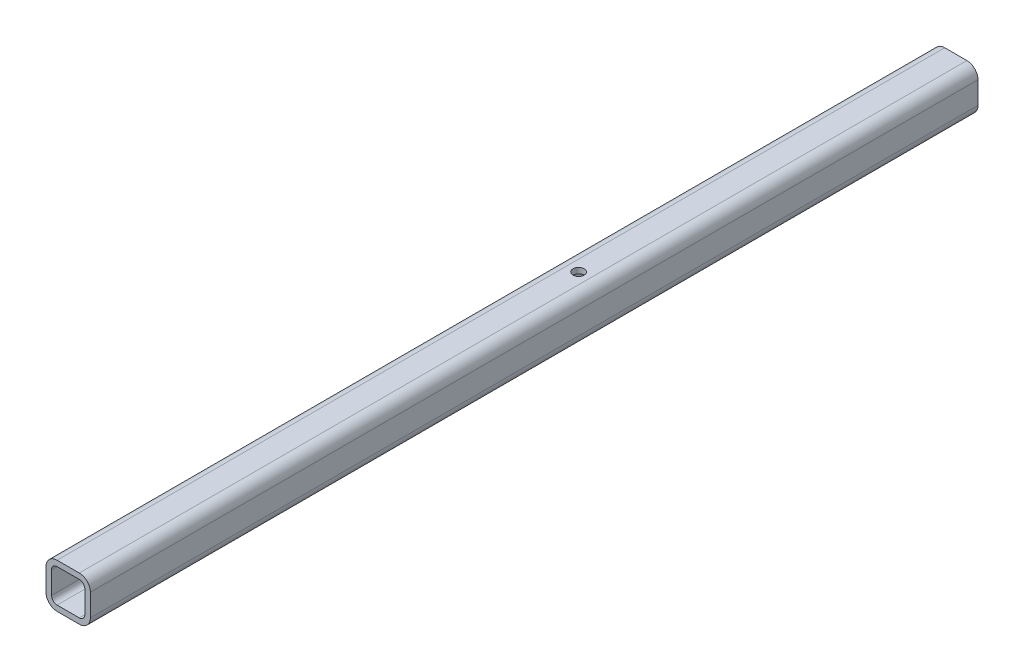
ISO-10303-21;
HEADER;
FILE_DESCRIPTION(('STEP AP214'),'2;1');
FILE_NAME('part.step','',(''),(''),'','','');
FILE_SCHEMA(('AUTOMOTIVE_DESIGN { 1 0 10303 214 1 1 1 1 }'));
ENDSEC;
DATA;
#1=APPLICATION_CONTEXT('core data for automotive mechanical design processes');
#2=APPLICATION_PROTOCOL_DEFINITION('international standard','automotive_design',2000,#1);
#3=PRODUCT_CONTEXT('',#1,'mechanical');
#4=PRODUCT('Part','Part','',(#3));
#5=PRODUCT_RELATED_PRODUCT_CATEGORY('part','',(#4));
#6=PRODUCT_DEFINITION_FORMATION('','',#4);
#7=PRODUCT_DEFINITION_CONTEXT('part definition',#1,'design');
#8=PRODUCT_DEFINITION('design','',#6,#7);
#9=PRODUCT_DEFINITION_SHAPE('','',#8);
#10=(LENGTH_UNIT() NAMED_UNIT(*) SI_UNIT(.MILLI.,.METRE.));
#11=(NAMED_UNIT(*) PLANE_ANGLE_UNIT() SI_UNIT($,.RADIAN.));
#12=(NAMED_UNIT(*) SI_UNIT($,.STERADIAN.) SOLID_ANGLE_UNIT());
#13=UNCERTAINTY_MEASURE_WITH_UNIT(LENGTH_MEASURE(1.E-05),#10,'distance_accuracy_value','');
#14=(GEOMETRIC_REPRESENTATION_CONTEXT(3) GLOBAL_UNCERTAINTY_ASSIGNED_CONTEXT((#13)) GLOBAL_UNIT_ASSIGNED_CONTEXT((#10,
#11,#12)) REPRESENTATION_CONTEXT('',''));
#15=CARTESIAN_POINT('',(0.,0.,0.));
#16=DIRECTION('',(0.,0.,1.));
#17=DIRECTION('',(1.,0.,0.));
#18=AXIS2_PLACEMENT_3D('',#15,#16,#17);
#19=CARTESIAN_POINT('',(38.1,38.1,508.));
#20=DIRECTION('',(0.,0.,1.));
#21=DIRECTION('',(1.,0.,0.));
#22=AXIS2_PLACEMENT_3D('',#19,#20,#21);
#23=PLANE('',#22);
#24=CARTESIAN_POINT('',(38.1,38.1,508.));
#25=DIRECTION('',(0.,0.,1.));
#26=DIRECTION('',(1.,0.,0.));
#27=AXIS2_PLACEMENT_3D('',#24,#25,#26);
#28=CIRCLE('',#27,12.7);
#29=CARTESIAN_POINT('',(50.8,38.1,508.));
#30=VERTEX_POINT('',#29);
#31=CARTESIAN_POINT('',(38.1,50.8,508.));
#32=VERTEX_POINT('',#31);
#33=EDGE_CURVE('E278',#30,#32,#28,.T.);
#34=ORIENTED_EDGE('',*,*,#33,.T.);
#35=DIRECTION('',(-1.,0.,0.));
#36=VECTOR('',#35,1.);
#37=CARTESIAN_POINT('',(38.1,50.8,508.));
#38=LINE('',#37,#36);
#39=CARTESIAN_POINT('',(12.7,50.8,508.));
#40=VERTEX_POINT('',#39);
#41=EDGE_CURVE('E281',#32,#40,#38,.T.);
#42=ORIENTED_EDGE('',*,*,#41,.T.);
#43=CARTESIAN_POINT('',(12.7,38.1,508.));
#44=DIRECTION('',(0.,0.,1.));
#45=DIRECTION('',(1.,0.,0.));
#46=AXIS2_PLACEMENT_3D('',#43,#44,#45);
#47=CIRCLE('',#46,12.7);
#48=CARTESIAN_POINT('',(0.,38.1,508.));
#49=VERTEX_POINT('',#48);
#50=EDGE_CURVE('E284',#40,#49,#47,.T.);
#51=ORIENTED_EDGE('',*,*,#50,.T.);
#52=DIRECTION('',(0.,-1.,0.));
#53=VECTOR('',#52,1.);
#54=CARTESIAN_POINT('',(0.,12.7,508.));
#55=LINE('',#54,#53);
#56=CARTESIAN_POINT('',(0.,12.7,508.));
#57=VERTEX_POINT('',#56);
#58=EDGE_CURVE('E286',#49,#57,#55,.T.);
#59=ORIENTED_EDGE('',*,*,#58,.T.);
#60=CARTESIAN_POINT('',(12.7,12.7,508.));
#61=DIRECTION('',(0.,0.,1.));
#62=DIRECTION('',(1.,0.,0.));
#63=AXIS2_PLACEMENT_3D('',#60,#61,#62);
#64=CIRCLE('',#63,12.7);
#65=CARTESIAN_POINT('',(12.7,0.,508.));
#66=VERTEX_POINT('',#65);
#67=EDGE_CURVE('E288',#57,#66,#64,.T.);
#68=ORIENTED_EDGE('',*,*,#67,.T.);
#69=DIRECTION('',(1.,0.,0.));
#70=VECTOR('',#69,1.);
#71=CARTESIAN_POINT('',(12.7,0.,508.));
#72=LINE('',#71,#70);
#73=CARTESIAN_POINT('',(38.1,0.,508.));
#74=VERTEX_POINT('',#73);
#75=EDGE_CURVE('E290',#66,#74,#72,.T.);
#76=ORIENTED_EDGE('',*,*,#75,.T.);
#77=CARTESIAN_POINT('',(38.1,12.7,508.));
#78=DIRECTION('',(0.,0.,1.));
#79=DIRECTION('',(1.,0.,0.));
#80=AXIS2_PLACEMENT_3D('',#77,#78,#79);
#81=CIRCLE('',#80,12.7);
#82=CARTESIAN_POINT('',(50.8,12.7,508.));
#83=VERTEX_POINT('',#82);
#84=EDGE_CURVE('E292',#74,#83,#81,.T.);
#85=ORIENTED_EDGE('',*,*,#84,.T.);
#86=DIRECTION('',(0.,1.,0.));
#87=VECTOR('',#86,1.);
#88=CARTESIAN_POINT('',(50.8,38.1,508.));
#89=LINE('',#88,#87);
#90=EDGE_CURVE('E294',#83,#30,#89,.T.);
#91=ORIENTED_EDGE('',*,*,#90,.T.);
#92=EDGE_LOOP('',(#34,#42,#51,#59,#68,#76,#85,#91));
#93=FACE_BOUND('',#92,.T.);
#94=DIRECTION('',(0.,-1.,0.));
#95=VECTOR('',#94,1.);
#96=CARTESIAN_POINT('',(6.35,12.7,508.));
#97=LINE('',#96,#95);
#98=CARTESIAN_POINT('',(6.35,38.1,508.));
#99=VERTEX_POINT('',#98);
#100=CARTESIAN_POINT('',(6.35,12.7,508.));
#101=VERTEX_POINT('',#100);
#102=EDGE_CURVE('E221',#99,#101,#97,.T.);
#103=ORIENTED_EDGE('',*,*,#102,.F.);
#104=CARTESIAN_POINT('',(12.7,38.1,508.));
#105=DIRECTION('',(0.,0.,1.));
#106=DIRECTION('',(1.,0.,0.));
#107=AXIS2_PLACEMENT_3D('',#104,#105,#106);
#108=CIRCLE('',#107,6.35);
#109=CARTESIAN_POINT('',(12.7,44.45,508.));
#110=VERTEX_POINT('',#109);
#111=EDGE_CURVE('E219',#110,#99,#108,.T.);
#112=ORIENTED_EDGE('',*,*,#111,.F.);
#113=DIRECTION('',(-1.,0.,0.));
#114=VECTOR('',#113,1.);
#115=CARTESIAN_POINT('',(38.1,44.45,508.));
#116=LINE('',#115,#114);
#117=CARTESIAN_POINT('',(38.1,44.45,508.));
#118=VERTEX_POINT('',#117);
#119=EDGE_CURVE('E235',#118,#110,#116,.T.);
#120=ORIENTED_EDGE('',*,*,#119,.F.);
#121=CARTESIAN_POINT('',(38.1,38.1,508.));
#122=DIRECTION('',(0.,0.,1.));
#123=DIRECTION('',(1.,0.,0.));
#124=AXIS2_PLACEMENT_3D('',#121,#122,#123);
#125=CIRCLE('',#124,6.35);
#126=CARTESIAN_POINT('',(44.45,38.1,508.));
#127=VERTEX_POINT('',#126);
#128=EDGE_CURVE('E232',#127,#118,#125,.T.);
#129=ORIENTED_EDGE('',*,*,#128,.F.);
#130=DIRECTION('',(0.,1.,0.));
#131=VECTOR('',#130,1.);
#132=CARTESIAN_POINT('',(44.45,38.1,508.));
#133=LINE('',#132,#131);
#134=CARTESIAN_POINT('',(44.45,12.7,508.));
#135=VERTEX_POINT('',#134);
#136=EDGE_CURVE('E230',#135,#127,#133,.T.);
#137=ORIENTED_EDGE('',*,*,#136,.F.);
#138=CARTESIAN_POINT('',(38.1,12.7,508.));
#139=DIRECTION('',(0.,0.,1.));
#140=DIRECTION('',(1.,0.,0.));
#141=AXIS2_PLACEMENT_3D('',#138,#139,#140);
#142=CIRCLE('',#141,6.35);
#143=CARTESIAN_POINT('',(38.1,6.35,508.));
#144=VERTEX_POINT('',#143);
#145=EDGE_CURVE('E228',#144,#135,#142,.T.);
#146=ORIENTED_EDGE('',*,*,#145,.F.);
#147=DIRECTION('',(1.,0.,0.));
#148=VECTOR('',#147,1.);
#149=CARTESIAN_POINT('',(12.7,6.34999999999999,508.));
#150=LINE('',#149,#148);
#151=CARTESIAN_POINT('',(12.7,6.34999999999999,508.));
#152=VERTEX_POINT('',#151);
#153=EDGE_CURVE('E226',#152,#144,#150,.T.);
#154=ORIENTED_EDGE('',*,*,#153,.F.);
#155=CARTESIAN_POINT('',(12.7,12.7,508.));
#156=DIRECTION('',(0.,0.,1.));
#157=DIRECTION('',(1.,0.,0.));
#158=AXIS2_PLACEMENT_3D('',#155,#156,#157);
#159=CIRCLE('',#158,6.35);
#160=EDGE_CURVE('E224',#101,#152,#159,.T.);
#161=ORIENTED_EDGE('',*,*,#160,.F.);
#162=EDGE_LOOP('',(#103,#112,#120,#129,#137,#146,#154,#161));
#163=FACE_BOUND('',#162,.T.);
#164=ADVANCED_FACE('F35',(#93,#163),#23,.T.);
#165=CARTESIAN_POINT('',(38.1,38.1,-508.));
#166=DIRECTION('',(0.,0.,1.));
#167=DIRECTION('',(1.,0.,0.));
#168=AXIS2_PLACEMENT_3D('',#165,#166,#167);
#169=PLANE('',#168);
#170=CARTESIAN_POINT('',(38.1,38.1,-508.));
#171=DIRECTION('',(0.,0.,1.));
#172=DIRECTION('',(1.,0.,0.));
#173=AXIS2_PLACEMENT_3D('',#170,#171,#172);
#174=CIRCLE('',#173,12.7);
#175=CARTESIAN_POINT('',(50.8,38.1,-508.));
#176=VERTEX_POINT('',#175);
#177=CARTESIAN_POINT('',(38.1,50.8,-508.));
#178=VERTEX_POINT('',#177);
#179=EDGE_CURVE('E277',#176,#178,#174,.T.);
#180=ORIENTED_EDGE('',*,*,#179,.F.);
#181=DIRECTION('',(0.,1.,0.));
#182=VECTOR('',#181,1.);
#183=CARTESIAN_POINT('',(50.8,38.1,-508.));
#184=LINE('',#183,#182);
#185=CARTESIAN_POINT('',(50.8,12.7,-508.));
#186=VERTEX_POINT('',#185);
#187=EDGE_CURVE('E282',#186,#176,#184,.T.);
#188=ORIENTED_EDGE('',*,*,#187,.F.);
#189=CARTESIAN_POINT('',(38.1,12.7,-508.));
#190=DIRECTION('',(0.,0.,1.));
#191=DIRECTION('',(1.,0.,0.));
#192=AXIS2_PLACEMENT_3D('',#189,#190,#191);
#193=CIRCLE('',#192,12.7);
#194=CARTESIAN_POINT('',(38.1,0.,-508.));
#195=VERTEX_POINT('',#194);
#196=EDGE_CURVE('E309',#195,#186,#193,.T.);
#197=ORIENTED_EDGE('',*,*,#196,.F.);
#198=DIRECTION('',(1.,0.,0.));
#199=VECTOR('',#198,1.);
#200=CARTESIAN_POINT('',(12.7,0.,-508.));
#201=LINE('',#200,#199);
#202=CARTESIAN_POINT('',(12.7,0.,-508.));
#203=VERTEX_POINT('',#202);
#204=EDGE_CURVE('E307',#203,#195,#201,.T.);
#205=ORIENTED_EDGE('',*,*,#204,.F.);
#206=CARTESIAN_POINT('',(12.7,12.7,-508.));
#207=DIRECTION('',(0.,0.,1.));
#208=DIRECTION('',(1.,0.,0.));
#209=AXIS2_PLACEMENT_3D('',#206,#207,#208);
#210=CIRCLE('',#209,12.7);
#211=CARTESIAN_POINT('',(0.,12.7,-508.));
#212=VERTEX_POINT('',#211);
#213=EDGE_CURVE('E305',#212,#203,#210,.T.);
#214=ORIENTED_EDGE('',*,*,#213,.F.);
#215=DIRECTION('',(0.,-1.,0.));
#216=VECTOR('',#215,1.);
#217=CARTESIAN_POINT('',(0.,12.7,-508.));
#218=LINE('',#217,#216);
#219=CARTESIAN_POINT('',(0.,38.1,-508.));
#220=VERTEX_POINT('',#219);
#221=EDGE_CURVE('E303',#220,#212,#218,.T.);
#222=ORIENTED_EDGE('',*,*,#221,.F.);
#223=CARTESIAN_POINT('',(12.7,38.1,-508.));
#224=DIRECTION('',(0.,0.,1.));
#225=DIRECTION('',(1.,0.,0.));
#226=AXIS2_PLACEMENT_3D('',#223,#224,#225);
#227=CIRCLE('',#226,12.7);
#228=CARTESIAN_POINT('',(12.7,50.8,-508.));
#229=VERTEX_POINT('',#228);
#230=EDGE_CURVE('E301',#229,#220,#227,.T.);
#231=ORIENTED_EDGE('',*,*,#230,.F.);
#232=DIRECTION('',(-1.,0.,0.));
#233=VECTOR('',#232,1.);
#234=CARTESIAN_POINT('',(38.1,50.8,-508.));
#235=LINE('',#234,#233);
#236=EDGE_CURVE('E299',#178,#229,#235,.T.);
#237=ORIENTED_EDGE('',*,*,#236,.F.);
#238=EDGE_LOOP('',(#180,#188,#197,#205,#214,#222,#231,#237));
#239=FACE_BOUND('',#238,.T.);
#240=CARTESIAN_POINT('',(12.7,38.1,-508.));
#241=DIRECTION('',(0.,0.,1.));
#242=DIRECTION('',(1.,0.,0.));
#243=AXIS2_PLACEMENT_3D('',#240,#241,#242);
#244=CIRCLE('',#243,6.35);
#245=CARTESIAN_POINT('',(12.7,44.45,-508.));
#246=VERTEX_POINT('',#245);
#247=CARTESIAN_POINT('',(6.35,38.1,-508.));
#248=VERTEX_POINT('',#247);
#249=EDGE_CURVE('E218',#246,#248,#244,.T.);
#250=ORIENTED_EDGE('',*,*,#249,.T.);
#251=DIRECTION('',(0.,-1.,0.));
#252=VECTOR('',#251,1.);
#253=CARTESIAN_POINT('',(6.35,12.7,-508.));
#254=LINE('',#253,#252);
#255=CARTESIAN_POINT('',(6.35,12.7,-508.));
#256=VERTEX_POINT('',#255);
#257=EDGE_CURVE('E240',#248,#256,#254,.T.);
#258=ORIENTED_EDGE('',*,*,#257,.T.);
#259=CARTESIAN_POINT('',(12.7,12.7,-508.));
#260=DIRECTION('',(0.,0.,1.));
#261=DIRECTION('',(1.,0.,0.));
#262=AXIS2_PLACEMENT_3D('',#259,#260,#261);
#263=CIRCLE('',#262,6.35);
#264=CARTESIAN_POINT('',(12.7,6.34999999999999,-508.));
#265=VERTEX_POINT('',#264);
#266=EDGE_CURVE('E243',#256,#265,#263,.T.);
#267=ORIENTED_EDGE('',*,*,#266,.T.);
#268=DIRECTION('',(1.,0.,0.));
#269=VECTOR('',#268,1.);
#270=CARTESIAN_POINT('',(12.7,6.34999999999999,-508.));
#271=LINE('',#270,#269);
#272=CARTESIAN_POINT('',(38.1,6.35,-508.));
#273=VERTEX_POINT('',#272);
#274=EDGE_CURVE('E246',#265,#273,#271,.T.);
#275=ORIENTED_EDGE('',*,*,#274,.T.);
#276=CARTESIAN_POINT('',(38.1,12.7,-508.));
#277=DIRECTION('',(0.,0.,1.));
#278=DIRECTION('',(1.,0.,0.));
#279=AXIS2_PLACEMENT_3D('',#276,#277,#278);
#280=CIRCLE('',#279,6.35);
#281=CARTESIAN_POINT('',(44.45,12.7,-508.));
#282=VERTEX_POINT('',#281);
#283=EDGE_CURVE('E249',#273,#282,#280,.T.);
#284=ORIENTED_EDGE('',*,*,#283,.T.);
#285=DIRECTION('',(0.,1.,0.));
#286=VECTOR('',#285,1.);
#287=CARTESIAN_POINT('',(44.45,38.1,-508.));
#288=LINE('',#287,#286);
#289=CARTESIAN_POINT('',(44.45,38.1,-508.));
#290=VERTEX_POINT('',#289);
#291=EDGE_CURVE('E252',#282,#290,#288,.T.);
#292=ORIENTED_EDGE('',*,*,#291,.T.);
#293=CARTESIAN_POINT('',(38.1,38.1,-508.));
#294=DIRECTION('',(0.,0.,1.));
#295=DIRECTION('',(1.,0.,0.));
#296=AXIS2_PLACEMENT_3D('',#293,#294,#295);
#297=CIRCLE('',#296,6.35);
#298=CARTESIAN_POINT('',(38.1,44.45,-508.));
#299=VERTEX_POINT('',#298);
#300=EDGE_CURVE('E255',#290,#299,#297,.T.);
#301=ORIENTED_EDGE('',*,*,#300,.T.);
#302=DIRECTION('',(-1.,0.,0.));
#303=VECTOR('',#302,1.);
#304=CARTESIAN_POINT('',(38.1,44.45,-508.));
#305=LINE('',#304,#303);
#306=EDGE_CURVE('E222',#299,#246,#305,.T.);
#307=ORIENTED_EDGE('',*,*,#306,.T.);
#308=EDGE_LOOP('',(#250,#258,#267,#275,#284,#292,#301,#307));
#309=FACE_BOUND('',#308,.T.);
#310=ADVANCED_FACE('F340',(#239,#309),#169,.F.);
#311=CARTESIAN_POINT('',(38.1,38.1,508.));
#312=DIRECTION('',(0.,0.,-1.));
#313=DIRECTION('',(-1.,0.,0.));
#314=AXIS2_PLACEMENT_3D('',#311,#312,#313);
#315=CYLINDRICAL_SURFACE('',#314,12.7);
#316=ORIENTED_EDGE('',*,*,#179,.T.);
#317=DIRECTION('',(0.,0.,-1.));
#318=VECTOR('',#317,1.);
#319=CARTESIAN_POINT('',(38.1,50.8,508.));
#320=LINE('',#319,#318);
#321=EDGE_CURVE('E11',#32,#178,#320,.T.);
#322=ORIENTED_EDGE('',*,*,#321,.F.);
#323=ORIENTED_EDGE('',*,*,#33,.F.);
#324=DIRECTION('',(0.,0.,-1.));
#325=VECTOR('',#324,1.);
#326=CARTESIAN_POINT('',(50.8,38.1,508.));
#327=LINE('',#326,#325);
#328=EDGE_CURVE('E296',#30,#176,#327,.T.);
#329=ORIENTED_EDGE('',*,*,#328,.T.);
#330=EDGE_LOOP('',(#316,#322,#323,#329));
#331=FACE_BOUND('',#330,.T.);
#332=ADVANCED_FACE('F37',(#331),#315,.T.);
#333=CARTESIAN_POINT('',(38.1,50.8,508.));
#334=DIRECTION('',(0.,-1.,0.));
#335=DIRECTION('',(1.,0.,0.));
#336=AXIS2_PLACEMENT_3D('',#333,#334,#335);
#337=PLANE('',#336);
#338=CARTESIAN_POINT('',(25.4,50.8,-76.1999999999999));
#339=DIRECTION('',(0.,1.,0.));
#340=DIRECTION('',(0.,0.,1.));
#341=AXIS2_PLACEMENT_3D('',#338,#339,#340);
#342=CIRCLE('',#341,6.34999999999999);
#343=CARTESIAN_POINT('',(25.4,50.8,-69.8499999999999));
#344=VERTEX_POINT('',#343);
#345=EDGE_CURVE('E190',#344,#344,#342,.T.);
#346=ORIENTED_EDGE('',*,*,#345,.F.);
#347=EDGE_LOOP('',(#346));
#348=FACE_BOUND('',#347,.T.);
#349=ORIENTED_EDGE('',*,*,#236,.T.);
#350=DIRECTION('',(0.,0.,-1.));
#351=VECTOR('',#350,1.);
#352=CARTESIAN_POINT('',(12.7,50.8,508.));
#353=LINE('',#352,#351);
#354=EDGE_CURVE('E44',#40,#229,#353,.T.);
#355=ORIENTED_EDGE('',*,*,#354,.F.);
#356=ORIENTED_EDGE('',*,*,#41,.F.);
#357=ORIENTED_EDGE('',*,*,#321,.T.);
#358=EDGE_LOOP('',(#349,#355,#356,#357));
#359=FACE_BOUND('',#358,.T.);
#360=ADVANCED_FACE('F358',(#348,#359),#337,.F.);
#361=CARTESIAN_POINT('',(12.7,38.1,508.));
#362=DIRECTION('',(0.,0.,-1.));
#363=DIRECTION('',(-1.,0.,0.));
#364=AXIS2_PLACEMENT_3D('',#361,#362,#363);
#365=CYLINDRICAL_SURFACE('',#364,12.7);
#366=ORIENTED_EDGE('',*,*,#230,.T.);
#367=DIRECTION('',(0.,0.,-1.));
#368=VECTOR('',#367,1.);
#369=CARTESIAN_POINT('',(0.,38.1,508.));
#370=LINE('',#369,#368);
#371=EDGE_CURVE('E326',#49,#220,#370,.T.);
#372=ORIENTED_EDGE('',*,*,#371,.F.);
#373=ORIENTED_EDGE('',*,*,#50,.F.);
#374=ORIENTED_EDGE('',*,*,#354,.T.);
#375=EDGE_LOOP('',(#366,#372,#373,#374));
#376=FACE_BOUND('',#375,.T.);
#377=ADVANCED_FACE('F334',(#376),#365,.T.);
#378=CARTESIAN_POINT('',(0.,12.7,508.));
#379=DIRECTION('',(1.,0.,0.));
#380=DIRECTION('',(0.,1.,0.));
#381=AXIS2_PLACEMENT_3D('',#378,#379,#380);
#382=PLANE('',#381);
#383=ORIENTED_EDGE('',*,*,#221,.T.);
#384=DIRECTION('',(0.,0.,-1.));
#385=VECTOR('',#384,1.);
#386=CARTESIAN_POINT('',(0.,12.7,508.));
#387=LINE('',#386,#385);
#388=EDGE_CURVE('E323',#57,#212,#387,.T.);
#389=ORIENTED_EDGE('',*,*,#388,.F.);
#390=ORIENTED_EDGE('',*,*,#58,.F.);
#391=ORIENTED_EDGE('',*,*,#371,.T.);
#392=EDGE_LOOP('',(#383,#389,#390,#391));
#393=FACE_BOUND('',#392,.T.);
#394=ADVANCED_FACE('F346',(#393),#382,.F.);
#395=CARTESIAN_POINT('',(12.7,12.7,508.));
#396=DIRECTION('',(0.,0.,-1.));
#397=DIRECTION('',(-1.,0.,0.));
#398=AXIS2_PLACEMENT_3D('',#395,#396,#397);
#399=CYLINDRICAL_SURFACE('',#398,12.7);
#400=ORIENTED_EDGE('',*,*,#213,.T.);
#401=DIRECTION('',(0.,0.,-1.));
#402=VECTOR('',#401,1.);
#403=CARTESIAN_POINT('',(12.7,0.,508.));
#404=LINE('',#403,#402);
#405=EDGE_CURVE('E320',#66,#203,#404,.T.);
#406=ORIENTED_EDGE('',*,*,#405,.F.);
#407=ORIENTED_EDGE('',*,*,#67,.F.);
#408=ORIENTED_EDGE('',*,*,#388,.T.);
#409=EDGE_LOOP('',(#400,#406,#407,#408));
#410=FACE_BOUND('',#409,.T.);
#411=ADVANCED_FACE('F350',(#410),#399,.T.);
#412=CARTESIAN_POINT('',(12.7,0.,508.));
#413=DIRECTION('',(0.,1.,0.));
#414=DIRECTION('',(-1.,0.,0.));
#415=AXIS2_PLACEMENT_3D('',#412,#413,#414);
#416=PLANE('',#415);
#417=DIRECTION('',(0.,0.,1.));
#418=VECTOR('',#417,1.);
#419=CARTESIAN_POINT('',(31.75,0.,-488.95));
#420=LINE('',#419,#418);
#421=CARTESIAN_POINT('',(31.75,0.,-488.95));
#422=VERTEX_POINT('',#421);
#423=CARTESIAN_POINT('',(31.75,0.,-469.9));
#424=VERTEX_POINT('',#423);
#425=EDGE_CURVE('E196',#422,#424,#420,.T.);
#426=ORIENTED_EDGE('',*,*,#425,.F.);
#427=CARTESIAN_POINT('',(25.4,0.,-488.95));
#428=DIRECTION('',(0.,-1.,0.));
#429=DIRECTION('',(1.,0.,0.));
#430=AXIS2_PLACEMENT_3D('',#427,#428,#429);
#431=CIRCLE('',#430,6.35);
#432=CARTESIAN_POINT('',(19.05,0.,-488.95));
#433=VERTEX_POINT('',#432);
#434=EDGE_CURVE('E51',#433,#422,#431,.T.);
#435=ORIENTED_EDGE('',*,*,#434,.F.);
#436=DIRECTION('',(0.,0.,-1.));
#437=VECTOR('',#436,1.);
#438=CARTESIAN_POINT('',(19.05,0.,-488.95));
#439=LINE('',#438,#437);
#440=CARTESIAN_POINT('',(19.05,0.,-469.9));
#441=VERTEX_POINT('',#440);
#442=EDGE_CURVE('E183',#441,#433,#439,.T.);
#443=ORIENTED_EDGE('',*,*,#442,.F.);
#444=CARTESIAN_POINT('',(25.4,0.,-469.9));
#445=DIRECTION('',(0.,-1.,0.));
#446=DIRECTION('',(1.,0.,0.));
#447=AXIS2_PLACEMENT_3D('',#444,#445,#446);
#448=CIRCLE('',#447,6.35);
#449=EDGE_CURVE('E191',#424,#441,#448,.T.);
#450=ORIENTED_EDGE('',*,*,#449,.F.);
#451=EDGE_LOOP('',(#426,#435,#443,#450));
#452=FACE_BOUND('',#451,.T.);
#453=CARTESIAN_POINT('',(25.4,0.,-76.1999999999999));
#454=DIRECTION('',(0.,1.,0.));
#455=DIRECTION('',(0.,0.,1.));
#456=AXIS2_PLACEMENT_3D('',#453,#454,#455);
#457=CIRCLE('',#456,6.34999999999999);
#458=CARTESIAN_POINT('',(25.4,0.,-69.8499999999999));
#459=VERTEX_POINT('',#458);
#460=EDGE_CURVE('E212',#459,#459,#457,.T.);
#461=ORIENTED_EDGE('',*,*,#460,.T.);
#462=EDGE_LOOP('',(#461));
#463=FACE_BOUND('',#462,.T.);
#464=ORIENTED_EDGE('',*,*,#204,.T.);
#465=DIRECTION('',(0.,0.,-1.));
#466=VECTOR('',#465,1.);
#467=CARTESIAN_POINT('',(38.1,0.,508.));
#468=LINE('',#467,#466);
#469=EDGE_CURVE('E317',#74,#195,#468,.T.);
#470=ORIENTED_EDGE('',*,*,#469,.F.);
#471=ORIENTED_EDGE('',*,*,#75,.F.);
#472=ORIENTED_EDGE('',*,*,#405,.T.);
#473=EDGE_LOOP('',(#464,#470,#471,#472));
#474=FACE_BOUND('',#473,.T.);
#475=ADVANCED_FACE('F194',(#452,#463,#474),#416,.F.);
#476=CARTESIAN_POINT('',(38.1,12.7,508.));
#477=DIRECTION('',(0.,0.,-1.));
#478=DIRECTION('',(-1.,0.,0.));
#479=AXIS2_PLACEMENT_3D('',#476,#477,#478);
#480=CYLINDRICAL_SURFACE('',#479,12.7);
#481=ORIENTED_EDGE('',*,*,#196,.T.);
#482=DIRECTION('',(0.,0.,-1.));
#483=VECTOR('',#482,1.);
#484=CARTESIAN_POINT('',(50.8,12.7,508.));
#485=LINE('',#484,#483);
#486=EDGE_CURVE('E314',#83,#186,#485,.T.);
#487=ORIENTED_EDGE('',*,*,#486,.F.);
#488=ORIENTED_EDGE('',*,*,#84,.F.);
#489=ORIENTED_EDGE('',*,*,#469,.T.);
#490=EDGE_LOOP('',(#481,#487,#488,#489));
#491=FACE_BOUND('',#490,.T.);
#492=ADVANCED_FACE('F369',(#491),#480,.T.);
#493=CARTESIAN_POINT('',(50.8,38.1,508.));
#494=DIRECTION('',(-1.,0.,0.));
#495=DIRECTION('',(0.,-1.,0.));
#496=AXIS2_PLACEMENT_3D('',#493,#494,#495);
#497=PLANE('',#496);
#498=ORIENTED_EDGE('',*,*,#187,.T.);
#499=ORIENTED_EDGE('',*,*,#328,.F.);
#500=ORIENTED_EDGE('',*,*,#90,.F.);
#501=ORIENTED_EDGE('',*,*,#486,.T.);
#502=EDGE_LOOP('',(#498,#499,#500,#501));
#503=FACE_BOUND('',#502,.T.);
#504=ADVANCED_FACE('F364',(#503),#497,.F.);
#505=CARTESIAN_POINT('',(12.7,38.1,508.));
#506=DIRECTION('',(0.,0.,-1.));
#507=DIRECTION('',(-1.,0.,0.));
#508=AXIS2_PLACEMENT_3D('',#505,#506,#507);
#509=CYLINDRICAL_SURFACE('',#508,6.35);
#510=ORIENTED_EDGE('',*,*,#249,.F.);
#511=DIRECTION('',(0.,0.,-1.));
#512=VECTOR('',#511,1.);
#513=CARTESIAN_POINT('',(12.7,44.45,508.));
#514=LINE('',#513,#512);
#515=EDGE_CURVE('E237',#110,#246,#514,.T.);
#516=ORIENTED_EDGE('',*,*,#515,.F.);
#517=ORIENTED_EDGE('',*,*,#111,.T.);
#518=DIRECTION('',(0.,0.,-1.));
#519=VECTOR('',#518,1.);
#520=CARTESIAN_POINT('',(6.35,38.1,508.));
#521=LINE('',#520,#519);
#522=EDGE_CURVE('E274',#99,#248,#521,.T.);
#523=ORIENTED_EDGE('',*,*,#522,.T.);
#524=EDGE_LOOP('',(#510,#516,#517,#523));
#525=FACE_BOUND('',#524,.T.);
#526=ADVANCED_FACE('F386',(#525),#509,.F.);
#527=CARTESIAN_POINT('',(6.35,12.7,508.));
#528=DIRECTION('',(1.,0.,0.));
#529=DIRECTION('',(0.,1.,0.));
#530=AXIS2_PLACEMENT_3D('',#527,#528,#529);
#531=PLANE('',#530);
#532=ORIENTED_EDGE('',*,*,#257,.F.);
#533=ORIENTED_EDGE('',*,*,#522,.F.);
#534=ORIENTED_EDGE('',*,*,#102,.T.);
#535=DIRECTION('',(0.,0.,-1.));
#536=VECTOR('',#535,1.);
#537=CARTESIAN_POINT('',(6.35,12.7,508.));
#538=LINE('',#537,#536);
#539=EDGE_CURVE('E272',#101,#256,#538,.T.);
#540=ORIENTED_EDGE('',*,*,#539,.T.);
#541=EDGE_LOOP('',(#532,#533,#534,#540));
#542=FACE_BOUND('',#541,.T.);
#543=ADVANCED_FACE('F393',(#542),#531,.T.);
#544=CARTESIAN_POINT('',(12.7,12.7,508.));
#545=DIRECTION('',(0.,0.,-1.));
#546=DIRECTION('',(-1.,0.,0.));
#547=AXIS2_PLACEMENT_3D('',#544,#545,#546);
#548=CYLINDRICAL_SURFACE('',#547,6.35);
#549=ORIENTED_EDGE('',*,*,#266,.F.);
#550=ORIENTED_EDGE('',*,*,#539,.F.);
#551=ORIENTED_EDGE('',*,*,#160,.T.);
#552=DIRECTION('',(0.,0.,-1.));
#553=VECTOR('',#552,1.);
#554=CARTESIAN_POINT('',(12.7,6.34999999999999,508.));
#555=LINE('',#554,#553);
#556=EDGE_CURVE('E270',#152,#265,#555,.T.);
#557=ORIENTED_EDGE('',*,*,#556,.T.);
#558=EDGE_LOOP('',(#549,#550,#551,#557));
#559=FACE_BOUND('',#558,.T.);
#560=ADVANCED_FACE('F398',(#559),#548,.F.);
#561=CARTESIAN_POINT('',(12.7,6.34999999999999,508.));
#562=DIRECTION('',(0.,1.,0.));
#563=DIRECTION('',(-1.,0.,0.));
#564=AXIS2_PLACEMENT_3D('',#561,#562,#563);
#565=PLANE('',#564);
#566=CARTESIAN_POINT('',(25.4,6.35,-488.95));
#567=DIRECTION('',(0.,1.,0.));
#568=DIRECTION('',(-1.,0.,0.));
#569=AXIS2_PLACEMENT_3D('',#566,#567,#568);
#570=CIRCLE('',#569,6.35);
#571=CARTESIAN_POINT('',(19.05,6.34999999999999,-488.95));
#572=VERTEX_POINT('',#571);
#573=CARTESIAN_POINT('',(31.75,6.35,-488.95));
#574=VERTEX_POINT('',#573);
#575=EDGE_CURVE('E176',#572,#574,#570,.F.);
#576=ORIENTED_EDGE('',*,*,#575,.T.);
#577=DIRECTION('',(0.,0.,1.));
#578=VECTOR('',#577,1.);
#579=CARTESIAN_POINT('',(31.75,6.35,-488.95));
#580=LINE('',#579,#578);
#581=CARTESIAN_POINT('',(31.75,6.35,-469.9));
#582=VERTEX_POINT('',#581);
#583=EDGE_CURVE('E199',#574,#582,#580,.T.);
#584=ORIENTED_EDGE('',*,*,#583,.T.);
#585=CARTESIAN_POINT('',(25.4,6.35,-469.9));
#586=DIRECTION('',(0.,1.,0.));
#587=DIRECTION('',(-1.,0.,0.));
#588=AXIS2_PLACEMENT_3D('',#585,#586,#587);
#589=CIRCLE('',#588,6.35);
#590=CARTESIAN_POINT('',(19.05,6.35,-469.9));
#591=VERTEX_POINT('',#590);
#592=EDGE_CURVE('E179',#582,#591,#589,.F.);
#593=ORIENTED_EDGE('',*,*,#592,.T.);
#594=DIRECTION('',(0.,0.,-1.));
#595=VECTOR('',#594,1.);
#596=CARTESIAN_POINT('',(19.05,6.34999999999999,-488.95));
#597=LINE('',#596,#595);
#598=EDGE_CURVE('E180',#591,#572,#597,.T.);
#599=ORIENTED_EDGE('',*,*,#598,.T.);
#600=EDGE_LOOP('',(#576,#584,#593,#599));
#601=FACE_BOUND('',#600,.T.);
#602=CARTESIAN_POINT('',(25.4,6.34999999999999,-76.1999999999999));
#603=DIRECTION('',(0.,1.,0.));
#604=DIRECTION('',(-1.,0.,0.));
#605=AXIS2_PLACEMENT_3D('',#602,#603,#604);
#606=CIRCLE('',#605,6.34999999999999);
#607=CARTESIAN_POINT('',(19.05,6.34999999999999,-76.1999999999999));
#608=VERTEX_POINT('',#607);
#609=EDGE_CURVE('E215',#608,#608,#606,.T.);
#610=ORIENTED_EDGE('',*,*,#609,.F.);
#611=EDGE_LOOP('',(#610));
#612=FACE_BOUND('',#611,.T.);
#613=ORIENTED_EDGE('',*,*,#274,.F.);
#614=ORIENTED_EDGE('',*,*,#556,.F.);
#615=ORIENTED_EDGE('',*,*,#153,.T.);
#616=DIRECTION('',(0.,0.,-1.));
#617=VECTOR('',#616,1.);
#618=CARTESIAN_POINT('',(38.1,6.35,508.));
#619=LINE('',#618,#617);
#620=EDGE_CURVE('E268',#144,#273,#619,.T.);
#621=ORIENTED_EDGE('',*,*,#620,.T.);
#622=EDGE_LOOP('',(#613,#614,#615,#621));
#623=FACE_BOUND('',#622,.T.);
#624=ADVANCED_FACE('F423',(#601,#612,#623),#565,.T.);
#625=CARTESIAN_POINT('',(38.1,12.7,508.));
#626=DIRECTION('',(0.,0.,-1.));
#627=DIRECTION('',(-1.,0.,0.));
#628=AXIS2_PLACEMENT_3D('',#625,#626,#627);
#629=CYLINDRICAL_SURFACE('',#628,6.35);
#630=ORIENTED_EDGE('',*,*,#283,.F.);
#631=ORIENTED_EDGE('',*,*,#620,.F.);
#632=ORIENTED_EDGE('',*,*,#145,.T.);
#633=DIRECTION('',(0.,0.,-1.));
#634=VECTOR('',#633,1.);
#635=CARTESIAN_POINT('',(44.45,12.7,508.));
#636=LINE('',#635,#634);
#637=EDGE_CURVE('E266',#135,#282,#636,.T.);
#638=ORIENTED_EDGE('',*,*,#637,.T.);
#639=EDGE_LOOP('',(#630,#631,#632,#638));
#640=FACE_BOUND('',#639,.T.);
#641=ADVANCED_FACE('F428',(#640),#629,.F.);
#642=CARTESIAN_POINT('',(44.45,38.1,508.));
#643=DIRECTION('',(-1.,0.,0.));
#644=DIRECTION('',(0.,-1.,0.));
#645=AXIS2_PLACEMENT_3D('',#642,#643,#644);
#646=PLANE('',#645);
#647=ORIENTED_EDGE('',*,*,#291,.F.);
#648=ORIENTED_EDGE('',*,*,#637,.F.);
#649=ORIENTED_EDGE('',*,*,#136,.T.);
#650=DIRECTION('',(0.,0.,-1.));
#651=VECTOR('',#650,1.);
#652=CARTESIAN_POINT('',(44.45,38.1,508.));
#653=LINE('',#652,#651);
#654=EDGE_CURVE('E264',#127,#290,#653,.T.);
#655=ORIENTED_EDGE('',*,*,#654,.T.);
#656=EDGE_LOOP('',(#647,#648,#649,#655));
#657=FACE_BOUND('',#656,.T.);
#658=ADVANCED_FACE('F431',(#657),#646,.T.);
#659=CARTESIAN_POINT('',(38.1,38.1,508.));
#660=DIRECTION('',(0.,0.,-1.));
#661=DIRECTION('',(-1.,0.,0.));
#662=AXIS2_PLACEMENT_3D('',#659,#660,#661);
#663=CYLINDRICAL_SURFACE('',#662,6.35);
#664=ORIENTED_EDGE('',*,*,#300,.F.);
#665=ORIENTED_EDGE('',*,*,#654,.F.);
#666=ORIENTED_EDGE('',*,*,#128,.T.);
#667=DIRECTION('',(0.,0.,-1.));
#668=VECTOR('',#667,1.);
#669=CARTESIAN_POINT('',(38.1,44.45,508.));
#670=LINE('',#669,#668);
#671=EDGE_CURVE('E262',#118,#299,#670,.T.);
#672=ORIENTED_EDGE('',*,*,#671,.T.);
#673=EDGE_LOOP('',(#664,#665,#666,#672));
#674=FACE_BOUND('',#673,.T.);
#675=ADVANCED_FACE('F411',(#674),#663,.F.);
#676=CARTESIAN_POINT('',(38.1,44.45,508.));
#677=DIRECTION('',(0.,-1.,0.));
#678=DIRECTION('',(1.,0.,0.));
#679=AXIS2_PLACEMENT_3D('',#676,#677,#678);
#680=PLANE('',#679);
#681=CARTESIAN_POINT('',(25.4,44.45,-76.1999999999999));
#682=DIRECTION('',(0.,-1.,0.));
#683=DIRECTION('',(1.,0.,0.));
#684=AXIS2_PLACEMENT_3D('',#681,#682,#683);
#685=CIRCLE('',#684,6.34999999999999);
#686=CARTESIAN_POINT('',(31.75,44.45,-76.1999999999999));
#687=VERTEX_POINT('',#686);
#688=EDGE_CURVE('E39',#687,#687,#685,.T.);
#689=ORIENTED_EDGE('',*,*,#688,.F.);
#690=EDGE_LOOP('',(#689));
#691=FACE_BOUND('',#690,.T.);
#692=ORIENTED_EDGE('',*,*,#306,.F.);
#693=ORIENTED_EDGE('',*,*,#671,.F.);
#694=ORIENTED_EDGE('',*,*,#119,.T.);
#695=ORIENTED_EDGE('',*,*,#515,.T.);
#696=EDGE_LOOP('',(#692,#693,#694,#695));
#697=FACE_BOUND('',#696,.T.);
#698=ADVANCED_FACE('F405',(#691,#697),#680,.T.);
#699=CARTESIAN_POINT('',(25.4,50.8,-76.1999999999999));
#700=DIRECTION('',(0.,1.,0.));
#701=DIRECTION('',(0.,0.,1.));
#702=AXIS2_PLACEMENT_3D('',#699,#700,#701);
#703=CYLINDRICAL_SURFACE('',#702,6.34999999999999);
#704=ORIENTED_EDGE('',*,*,#688,.T.);
#705=EDGE_LOOP('',(#704));
#706=FACE_BOUND('',#705,.T.);
#707=ORIENTED_EDGE('',*,*,#345,.T.);
#708=EDGE_LOOP('',(#707));
#709=FACE_BOUND('',#708,.T.);
#710=ADVANCED_FACE('F490',(#706,#709),#703,.F.);
#711=ORIENTED_EDGE('',*,*,#609,.T.);
#712=EDGE_LOOP('',(#711));
#713=FACE_BOUND('',#712,.T.);
#714=ORIENTED_EDGE('',*,*,#460,.F.);
#715=EDGE_LOOP('',(#714));
#716=FACE_BOUND('',#715,.T.);
#717=ADVANCED_FACE('F499',(#713,#716),#703,.F.);
#718=CARTESIAN_POINT('',(25.4,50.801,-488.95));
#719=DIRECTION('',(0.,-1.,0.));
#720=DIRECTION('',(1.,0.,0.));
#721=AXIS2_PLACEMENT_3D('',#718,#719,#720);
#722=CYLINDRICAL_SURFACE('',#721,6.35);
#723=DIRECTION('',(0.,-1.,0.));
#724=VECTOR('',#723,1.);
#725=CARTESIAN_POINT('',(19.05,50.801,-488.95));
#726=LINE('',#725,#724);
#727=EDGE_CURVE('E172',#572,#433,#726,.T.);
#728=ORIENTED_EDGE('',*,*,#727,.T.);
#729=ORIENTED_EDGE('',*,*,#434,.T.);
#730=DIRECTION('',(0.,-1.,0.));
#731=VECTOR('',#730,1.);
#732=CARTESIAN_POINT('',(31.75,50.801,-488.95));
#733=LINE('',#732,#731);
#734=EDGE_CURVE('E204',#574,#422,#733,.T.);
#735=ORIENTED_EDGE('',*,*,#734,.F.);
#736=ORIENTED_EDGE('',*,*,#575,.F.);
#737=EDGE_LOOP('',(#728,#729,#735,#736));
#738=FACE_BOUND('',#737,.T.);
#739=ADVANCED_FACE('F174',(#738),#722,.F.);
#740=CARTESIAN_POINT('',(19.05,50.801,-488.95));
#741=DIRECTION('',(-1.,0.,0.));
#742=DIRECTION('',(0.,-1.,0.));
#743=AXIS2_PLACEMENT_3D('',#740,#741,#742);
#744=PLANE('',#743);
#745=DIRECTION('',(0.,-1.,0.));
#746=VECTOR('',#745,1.);
#747=CARTESIAN_POINT('',(19.05,50.801,-469.9));
#748=LINE('',#747,#746);
#749=EDGE_CURVE('E186',#591,#441,#748,.T.);
#750=ORIENTED_EDGE('',*,*,#749,.T.);
#751=ORIENTED_EDGE('',*,*,#442,.T.);
#752=ORIENTED_EDGE('',*,*,#727,.F.);
#753=ORIENTED_EDGE('',*,*,#598,.F.);
#754=EDGE_LOOP('',(#750,#751,#752,#753));
#755=FACE_BOUND('',#754,.T.);
#756=ADVANCED_FACE('F184',(#755),#744,.F.);
#757=CARTESIAN_POINT('',(25.4,50.801,-469.9));
#758=DIRECTION('',(0.,-1.,0.));
#759=DIRECTION('',(1.,0.,0.));
#760=AXIS2_PLACEMENT_3D('',#757,#758,#759);
#761=CYLINDRICAL_SURFACE('',#760,6.35);
#762=DIRECTION('',(0.,-1.,0.));
#763=VECTOR('',#762,1.);
#764=CARTESIAN_POINT('',(31.75,50.801,-469.9));
#765=LINE('',#764,#763);
#766=EDGE_CURVE('E59',#582,#424,#765,.T.);
#767=ORIENTED_EDGE('',*,*,#766,.T.);
#768=ORIENTED_EDGE('',*,*,#449,.T.);
#769=ORIENTED_EDGE('',*,*,#749,.F.);
#770=ORIENTED_EDGE('',*,*,#592,.F.);
#771=EDGE_LOOP('',(#767,#768,#769,#770));
#772=FACE_BOUND('',#771,.T.);
#773=ADVANCED_FACE('F582',(#772),#761,.F.);
#774=CARTESIAN_POINT('',(31.75,50.801,-488.95));
#775=DIRECTION('',(1.,0.,0.));
#776=DIRECTION('',(0.,1.,0.));
#777=AXIS2_PLACEMENT_3D('',#774,#775,#776);
#778=PLANE('',#777);
#779=ORIENTED_EDGE('',*,*,#734,.T.);
#780=ORIENTED_EDGE('',*,*,#425,.T.);
#781=ORIENTED_EDGE('',*,*,#766,.F.);
#782=ORIENTED_EDGE('',*,*,#583,.F.);
#783=EDGE_LOOP('',(#779,#780,#781,#782));
#784=FACE_BOUND('',#783,.T.);
#785=ADVANCED_FACE('F589',(#784),#778,.F.);
#786=CLOSED_SHELL('',(#164,#310,#332,#360,#377,#394,#411,#475,#492,#504,#526,#543,#560,#624,
#641,#658,#675,#698,#710,#717,#739,#756,#773,#785));
#787=MANIFOLD_SOLID_BREP('B2',#786);
#788=ADVANCED_BREP_SHAPE_REPRESENTATION('',(#18,#787),#14);
#789=SHAPE_DEFINITION_REPRESENTATION(#9,#788);
ENDSEC;
END-ISO-10303-21;
